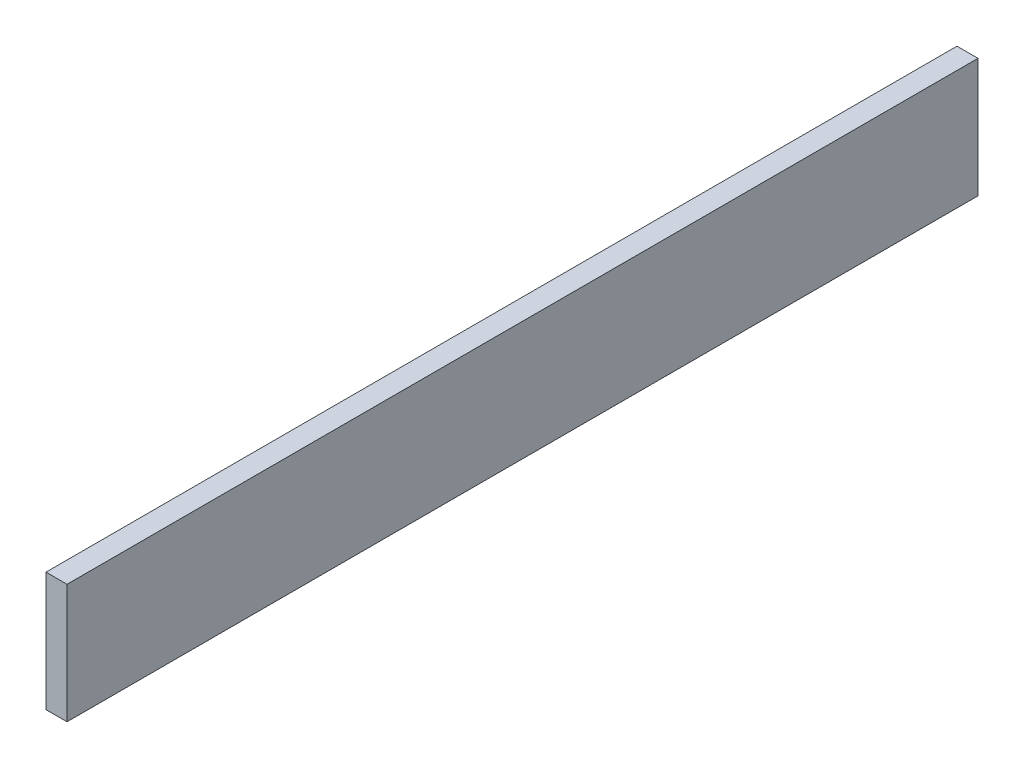
ISO-10303-21;
HEADER;
FILE_DESCRIPTION(('STEP AP214'),'2;1');
FILE_NAME('part.step','',(''),(''),'','','');
FILE_SCHEMA(('AUTOMOTIVE_DESIGN { 1 0 10303 214 1 1 1 1 }'));
ENDSEC;
DATA;
#1=APPLICATION_CONTEXT('core data for automotive mechanical design processes');
#2=APPLICATION_PROTOCOL_DEFINITION('international standard','automotive_design',2000,#1);
#3=PRODUCT_CONTEXT('',#1,'mechanical');
#4=PRODUCT('Part','Part','',(#3));
#5=PRODUCT_RELATED_PRODUCT_CATEGORY('part','',(#4));
#6=PRODUCT_DEFINITION_FORMATION('','',#4);
#7=PRODUCT_DEFINITION_CONTEXT('part definition',#1,'design');
#8=PRODUCT_DEFINITION('design','',#6,#7);
#9=PRODUCT_DEFINITION_SHAPE('','',#8);
#10=(LENGTH_UNIT() NAMED_UNIT(*) SI_UNIT(.MILLI.,.METRE.));
#11=(NAMED_UNIT(*) PLANE_ANGLE_UNIT() SI_UNIT($,.RADIAN.));
#12=(NAMED_UNIT(*) SI_UNIT($,.STERADIAN.) SOLID_ANGLE_UNIT());
#13=UNCERTAINTY_MEASURE_WITH_UNIT(LENGTH_MEASURE(1.E-05),#10,'distance_accuracy_value','');
#14=(GEOMETRIC_REPRESENTATION_CONTEXT(3) GLOBAL_UNCERTAINTY_ASSIGNED_CONTEXT((#13)) GLOBAL_UNIT_ASSIGNED_CONTEXT((#10,
#11,#12)) REPRESENTATION_CONTEXT('',''));
#15=CARTESIAN_POINT('',(0.,0.,0.));
#16=DIRECTION('',(0.,0.,1.));
#17=DIRECTION('',(1.,0.,0.));
#18=AXIS2_PLACEMENT_3D('',#15,#16,#17);
#19=CARTESIAN_POINT('',(3.,0.,0.));
#20=DIRECTION('',(0.,0.,-1.));
#21=DIRECTION('',(-1.,0.,0.));
#22=AXIS2_PLACEMENT_3D('',#19,#20,#21);
#23=PLANE('',#22);
#24=DIRECTION('',(0.,-1.,0.));
#25=VECTOR('',#24,1.);
#26=CARTESIAN_POINT('',(0.,0.,0.));
#27=LINE('',#26,#25);
#28=CARTESIAN_POINT('',(0.,17.,0.));
#29=VERTEX_POINT('',#28);
#30=CARTESIAN_POINT('',(0.,0.,0.));
#31=VERTEX_POINT('',#30);
#32=EDGE_CURVE('E96',#29,#31,#27,.T.);
#33=ORIENTED_EDGE('',*,*,#32,.T.);
#34=DIRECTION('',(-1.,0.,0.));
#35=VECTOR('',#34,1.);
#36=CARTESIAN_POINT('',(3.,0.,0.));
#37=LINE('',#36,#35);
#38=CARTESIAN_POINT('',(3.,0.,0.));
#39=VERTEX_POINT('',#38);
#40=EDGE_CURVE('E11',#39,#31,#37,.T.);
#41=ORIENTED_EDGE('',*,*,#40,.F.);
#42=DIRECTION('',(0.,-1.,0.));
#43=VECTOR('',#42,1.);
#44=CARTESIAN_POINT('',(3.,0.,0.));
#45=LINE('',#44,#43);
#46=CARTESIAN_POINT('',(3.,17.,0.));
#47=VERTEX_POINT('',#46);
#48=EDGE_CURVE('E84',#47,#39,#45,.T.);
#49=ORIENTED_EDGE('',*,*,#48,.F.);
#50=DIRECTION('',(-1.,0.,0.));
#51=VECTOR('',#50,1.);
#52=CARTESIAN_POINT('',(3.,17.,0.));
#53=LINE('',#52,#51);
#54=EDGE_CURVE('E92',#47,#29,#53,.T.);
#55=ORIENTED_EDGE('',*,*,#54,.T.);
#56=EDGE_LOOP('',(#33,#41,#49,#55));
#57=FACE_BOUND('',#56,.T.);
#58=ADVANCED_FACE('F33',(#57),#23,.F.);
#59=CARTESIAN_POINT('',(3.,0.,0.));
#60=DIRECTION('',(0.,1.,0.));
#61=DIRECTION('',(0.,0.,1.));
#62=AXIS2_PLACEMENT_3D('',#59,#60,#61);
#63=PLANE('',#62);
#64=DIRECTION('',(0.,0.,-1.));
#65=VECTOR('',#64,1.);
#66=CARTESIAN_POINT('',(0.,0.,0.));
#67=LINE('',#66,#65);
#68=CARTESIAN_POINT('',(0.,0.,-130.));
#69=VERTEX_POINT('',#68);
#70=EDGE_CURVE('E88',#31,#69,#67,.T.);
#71=ORIENTED_EDGE('',*,*,#70,.T.);
#72=DIRECTION('',(-1.,0.,0.));
#73=VECTOR('',#72,1.);
#74=CARTESIAN_POINT('',(3.,0.,-130.));
#75=LINE('',#74,#73);
#76=CARTESIAN_POINT('',(3.,0.,-130.));
#77=VERTEX_POINT('',#76);
#78=EDGE_CURVE('E41',#77,#69,#75,.T.);
#79=ORIENTED_EDGE('',*,*,#78,.F.);
#80=DIRECTION('',(0.,0.,-1.));
#81=VECTOR('',#80,1.);
#82=CARTESIAN_POINT('',(3.,0.,0.));
#83=LINE('',#82,#81);
#84=EDGE_CURVE('E79',#39,#77,#83,.T.);
#85=ORIENTED_EDGE('',*,*,#84,.F.);
#86=ORIENTED_EDGE('',*,*,#40,.T.);
#87=EDGE_LOOP('',(#71,#79,#85,#86));
#88=FACE_BOUND('',#87,.T.);
#89=ADVANCED_FACE('F87',(#88),#63,.F.);
#90=CARTESIAN_POINT('',(3.,0.,-130.));
#91=DIRECTION('',(0.,0.,1.));
#92=DIRECTION('',(1.,0.,0.));
#93=AXIS2_PLACEMENT_3D('',#90,#91,#92);
#94=PLANE('',#93);
#95=DIRECTION('',(0.,1.,0.));
#96=VECTOR('',#95,1.);
#97=CARTESIAN_POINT('',(0.,0.,-130.));
#98=LINE('',#97,#96);
#99=CARTESIAN_POINT('',(0.,17.,-130.));
#100=VERTEX_POINT('',#99);
#101=EDGE_CURVE('E66',#69,#100,#98,.T.);
#102=ORIENTED_EDGE('',*,*,#101,.T.);
#103=DIRECTION('',(-1.,0.,0.));
#104=VECTOR('',#103,1.);
#105=CARTESIAN_POINT('',(3.,17.,-130.));
#106=LINE('',#105,#104);
#107=CARTESIAN_POINT('',(3.,17.,-130.));
#108=VERTEX_POINT('',#107);
#109=EDGE_CURVE('E89',#108,#100,#106,.T.);
#110=ORIENTED_EDGE('',*,*,#109,.F.);
#111=DIRECTION('',(0.,1.,0.));
#112=VECTOR('',#111,1.);
#113=CARTESIAN_POINT('',(3.,0.,-130.));
#114=LINE('',#113,#112);
#115=EDGE_CURVE('E82',#77,#108,#114,.T.);
#116=ORIENTED_EDGE('',*,*,#115,.F.);
#117=ORIENTED_EDGE('',*,*,#78,.T.);
#118=EDGE_LOOP('',(#102,#110,#116,#117));
#119=FACE_BOUND('',#118,.T.);
#120=ADVANCED_FACE('F90',(#119),#94,.F.);
#121=CARTESIAN_POINT('',(3.,17.,0.));
#122=DIRECTION('',(0.,-1.,0.));
#123=DIRECTION('',(0.,0.,-1.));
#124=AXIS2_PLACEMENT_3D('',#121,#122,#123);
#125=PLANE('',#124);
#126=DIRECTION('',(0.,0.,1.));
#127=VECTOR('',#126,1.);
#128=CARTESIAN_POINT('',(0.,17.,0.));
#129=LINE('',#128,#127);
#130=EDGE_CURVE('E72',#100,#29,#129,.T.);
#131=ORIENTED_EDGE('',*,*,#130,.T.);
#132=ORIENTED_EDGE('',*,*,#54,.F.);
#133=DIRECTION('',(0.,0.,1.));
#134=VECTOR('',#133,1.);
#135=CARTESIAN_POINT('',(3.,17.,0.));
#136=LINE('',#135,#134);
#137=EDGE_CURVE('E49',#108,#47,#136,.T.);
#138=ORIENTED_EDGE('',*,*,#137,.F.);
#139=ORIENTED_EDGE('',*,*,#109,.T.);
#140=EDGE_LOOP('',(#131,#132,#138,#139));
#141=FACE_BOUND('',#140,.T.);
#142=ADVANCED_FACE('F103',(#141),#125,.F.);
#143=CARTESIAN_POINT('',(3.,0.,0.));
#144=DIRECTION('',(-1.,0.,0.));
#145=DIRECTION('',(0.,0.,1.));
#146=AXIS2_PLACEMENT_3D('',#143,#144,#145);
#147=PLANE('',#146);
#148=ORIENTED_EDGE('',*,*,#48,.T.);
#149=ORIENTED_EDGE('',*,*,#84,.T.);
#150=ORIENTED_EDGE('',*,*,#115,.T.);
#151=ORIENTED_EDGE('',*,*,#137,.T.);
#152=EDGE_LOOP('',(#148,#149,#150,#151));
#153=FACE_BOUND('',#152,.T.);
#154=ADVANCED_FACE('F80',(#153),#147,.F.);
#155=CARTESIAN_POINT('',(0.,0.,0.));
#156=DIRECTION('',(-1.,0.,0.));
#157=DIRECTION('',(0.,0.,1.));
#158=AXIS2_PLACEMENT_3D('',#155,#156,#157);
#159=PLANE('',#158);
#160=ORIENTED_EDGE('',*,*,#32,.F.);
#161=ORIENTED_EDGE('',*,*,#130,.F.);
#162=ORIENTED_EDGE('',*,*,#101,.F.);
#163=ORIENTED_EDGE('',*,*,#70,.F.);
#164=EDGE_LOOP('',(#160,#161,#162,#163));
#165=FACE_BOUND('',#164,.T.);
#166=ADVANCED_FACE('F106',(#165),#159,.T.);
#167=CLOSED_SHELL('',(#58,#89,#120,#142,#154,#166));
#168=MANIFOLD_SOLID_BREP('B2',#167);
#169=ADVANCED_BREP_SHAPE_REPRESENTATION('',(#18,#168),#14);
#170=SHAPE_DEFINITION_REPRESENTATION(#9,#169);
ENDSEC;
END-ISO-10303-21;
